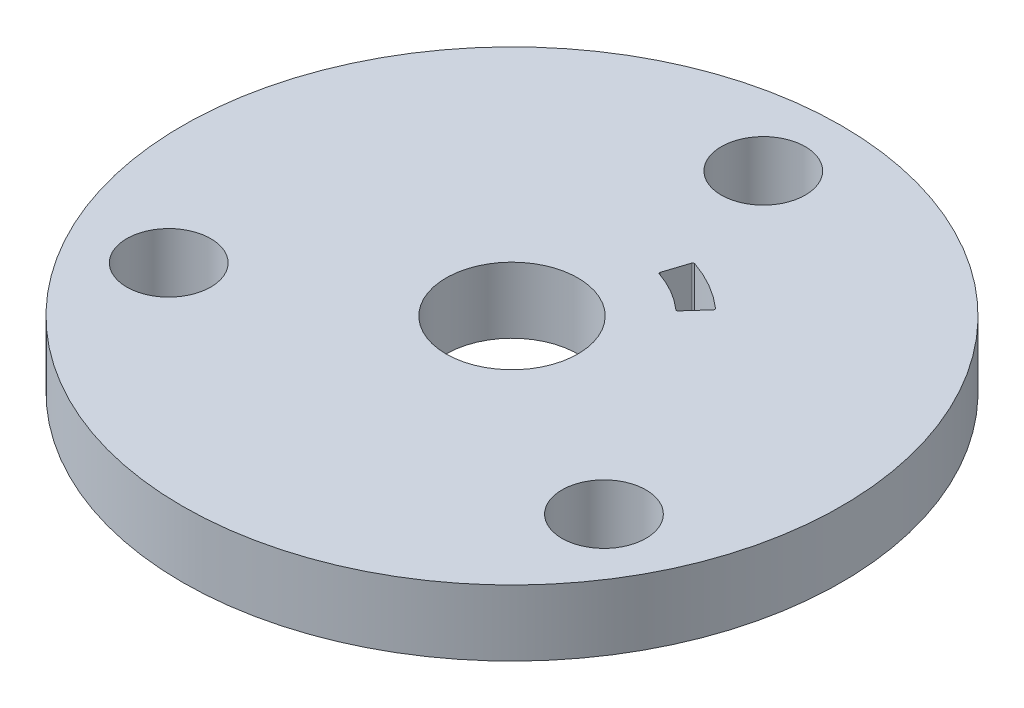
ISO-10303-21;
HEADER;
FILE_DESCRIPTION(('STEP AP214'),'2;1');
FILE_NAME('part.step','',(''),(''),'','','');
FILE_SCHEMA(('AUTOMOTIVE_DESIGN { 1 0 10303 214 1 1 1 1 }'));
ENDSEC;
DATA;
#1=APPLICATION_CONTEXT('core data for automotive mechanical design processes');
#2=APPLICATION_PROTOCOL_DEFINITION('international standard','automotive_design',2000,#1);
#3=PRODUCT_CONTEXT('',#1,'mechanical');
#4=PRODUCT('Part','Part','',(#3));
#5=PRODUCT_RELATED_PRODUCT_CATEGORY('part','',(#4));
#6=PRODUCT_DEFINITION_FORMATION('','',#4);
#7=PRODUCT_DEFINITION_CONTEXT('part definition',#1,'design');
#8=PRODUCT_DEFINITION('design','',#6,#7);
#9=PRODUCT_DEFINITION_SHAPE('','',#8);
#10=(LENGTH_UNIT() NAMED_UNIT(*) SI_UNIT(.MILLI.,.METRE.));
#11=(NAMED_UNIT(*) PLANE_ANGLE_UNIT() SI_UNIT($,.RADIAN.));
#12=(NAMED_UNIT(*) SI_UNIT($,.STERADIAN.) SOLID_ANGLE_UNIT());
#13=UNCERTAINTY_MEASURE_WITH_UNIT(LENGTH_MEASURE(1.E-05),#10,'distance_accuracy_value','');
#14=(GEOMETRIC_REPRESENTATION_CONTEXT(3) GLOBAL_UNCERTAINTY_ASSIGNED_CONTEXT((#13)) GLOBAL_UNIT_ASSIGNED_CONTEXT((#10,
#11,#12)) REPRESENTATION_CONTEXT('',''));
#15=CARTESIAN_POINT('',(0.,0.,0.));
#16=DIRECTION('',(0.,0.,1.));
#17=DIRECTION('',(1.,0.,0.));
#18=AXIS2_PLACEMENT_3D('',#15,#16,#17);
#19=CARTESIAN_POINT('',(0.,4.,0.));
#20=DIRECTION('',(0.,1.,0.));
#21=DIRECTION('',(0.,0.,1.));
#22=AXIS2_PLACEMENT_3D('',#19,#20,#21);
#23=PLANE('',#22);
#24=CARTESIAN_POINT('',(0.,4.,0.));
#25=DIRECTION('',(0.,1.,0.));
#26=DIRECTION('',(0.,0.,-1.));
#27=AXIS2_PLACEMENT_3D('',#24,#25,#26);
#28=CIRCLE('',#27,8.75);
#29=CARTESIAN_POINT('',(5.77932793090246,4.,-6.56976930090324));
#30=VERTEX_POINT('',#29);
#31=CARTESIAN_POINT('',(2.7999231461343,4.,-8.28992945541405));
#32=VERTEX_POINT('',#31);
#33=EDGE_CURVE('E132',#30,#32,#28,.T.);
#34=ORIENTED_EDGE('',*,*,#33,.F.);
#35=CARTESIAN_POINT('',(5.71327846883501,4.,-6.49468622317863));
#36=DIRECTION('',(0.,1.,0.));
#37=DIRECTION('',(0.,0.,1.));
#38=AXIS2_PLACEMENT_3D('',#35,#36,#37);
#39=CIRCLE('',#38,0.1);
#40=CARTESIAN_POINT('',(5.78759295138275,4.,-6.42777316254275));
#41=VERTEX_POINT('',#40);
#42=EDGE_CURVE('E183',#30,#41,#39,.F.);
#43=ORIENTED_EDGE('',*,*,#42,.T.);
#44=DIRECTION('',(0.669130606358867,0.,-0.743144825477386));
#45=VECTOR('',#44,1.);
#46=CARTESIAN_POINT('',(5.85489280564009,4.,-6.50251722292713));
#47=LINE('',#46,#45);
#48=CARTESIAN_POINT('',(4.78381588908025,4.,-5.31296579505114));
#49=VERTEX_POINT('',#48);
#50=EDGE_CURVE('E126',#49,#41,#47,.T.);
#51=ORIENTED_EDGE('',*,*,#50,.F.);
#52=CARTESIAN_POINT('',(4.70950140653251,4.,-5.37987885568702));
#53=DIRECTION('',(0.,1.,0.));
#54=DIRECTION('',(0.,0.,1.));
#55=AXIS2_PLACEMENT_3D('',#52,#53,#54);
#56=CIRCLE('',#55,0.1);
#57=CARTESIAN_POINT('',(4.64363425399359,4.,-5.30463579476832));
#58=VERTEX_POINT('',#57);
#59=EDGE_CURVE('E125',#49,#58,#56,.F.);
#60=ORIENTED_EDGE('',*,*,#59,.T.);
#61=CARTESIAN_POINT('',(0.,4.,0.));
#62=DIRECTION('',(0.,-1.,0.));
#63=DIRECTION('',(0.,0.,-1.));
#64=AXIS2_PLACEMENT_3D('',#61,#62,#63);
#65=CIRCLE('',#64,7.05);
#66=CARTESIAN_POINT('',(2.27213222909698,4.,-6.67382312722616));
#67=VERTEX_POINT('',#66);
#68=EDGE_CURVE('E115',#67,#58,#65,.T.);
#69=ORIENTED_EDGE('',*,*,#68,.F.);
#70=CARTESIAN_POINT('',(2.30436105504162,4.,-6.76848728505916));
#71=DIRECTION('',(0.,1.,0.));
#72=DIRECTION('',(0.,0.,1.));
#73=AXIS2_PLACEMENT_3D('',#70,#71,#72);
#74=CIRCLE('',#73,0.1);
#75=CARTESIAN_POINT('',(2.20925540341211,4.,-6.79938898449665));
#76=VERTEX_POINT('',#75);
#77=EDGE_CURVE('E98',#67,#76,#74,.F.);
#78=ORIENTED_EDGE('',*,*,#77,.T.);
#79=DIRECTION('',(-0.309016994374958,0.,0.95105651629515));
#80=VECTOR('',#79,1.);
#81=CARTESIAN_POINT('',(2.70389870078088,4.,-8.32174451758256));
#82=LINE('',#81,#80);
#83=CARTESIAN_POINT('',(2.67281837283468,4.,-8.22608910393253));
#84=VERTEX_POINT('',#83);
#85=EDGE_CURVE('E127',#84,#76,#82,.T.);
#86=ORIENTED_EDGE('',*,*,#85,.F.);
#87=CARTESIAN_POINT('',(2.76792402446419,4.,-8.19518740449503));
#88=DIRECTION('',(0.,1.,0.));
#89=DIRECTION('',(0.,0.,1.));
#90=AXIS2_PLACEMENT_3D('',#87,#88,#89);
#91=CIRCLE('',#90,0.1);
#92=EDGE_CURVE('E40',#84,#32,#91,.F.);
#93=ORIENTED_EDGE('',*,*,#92,.T.);
#94=EDGE_LOOP('',(#34,#43,#51,#60,#69,#78,#86,#93));
#95=FACE_BOUND('',#94,.T.);
#96=CARTESIAN_POINT('',(-13.2068874077127,4.,7.62500000000006));
#97=DIRECTION('',(0.,1.,0.));
#98=DIRECTION('',(0.866025403784436,0.,-0.500000000000004));
#99=AXIS2_PLACEMENT_3D('',#96,#97,#98);
#100=CIRCLE('',#99,2.55);
#101=CARTESIAN_POINT('',(-10.9985226280623,4.,6.35000000000005));
#102=VERTEX_POINT('',#101);
#103=EDGE_CURVE('E140',#102,#102,#100,.T.);
#104=ORIENTED_EDGE('',*,*,#103,.F.);
#105=EDGE_LOOP('',(#104));
#106=FACE_BOUND('',#105,.T.);
#107=CARTESIAN_POINT('',(13.2068874077128,4.,7.62499999999988));
#108=DIRECTION('',(0.,1.,0.));
#109=DIRECTION('',(-0.866025403784443,0.,-0.499999999999992));
#110=AXIS2_PLACEMENT_3D('',#107,#108,#109);
#111=CIRCLE('',#110,2.55);
#112=CARTESIAN_POINT('',(10.9985226280624,4.,6.3499999999999));
#113=VERTEX_POINT('',#112);
#114=EDGE_CURVE('E146',#113,#113,#111,.T.);
#115=ORIENTED_EDGE('',*,*,#114,.F.);
#116=EDGE_LOOP('',(#115));
#117=FACE_BOUND('',#116,.T.);
#118=CARTESIAN_POINT('',(0.,4.,-15.25));
#119=DIRECTION('',(0.,1.,0.));
#120=DIRECTION('',(0.,0.,1.));
#121=AXIS2_PLACEMENT_3D('',#118,#119,#120);
#122=CIRCLE('',#121,2.55);
#123=CARTESIAN_POINT('',(0.,4.,-12.7));
#124=VERTEX_POINT('',#123);
#125=EDGE_CURVE('E139',#124,#124,#122,.T.);
#126=ORIENTED_EDGE('',*,*,#125,.F.);
#127=EDGE_LOOP('',(#126));
#128=FACE_BOUND('',#127,.T.);
#129=CARTESIAN_POINT('',(0.,4.,0.));
#130=DIRECTION('',(0.,1.,0.));
#131=DIRECTION('',(0.,0.,1.));
#132=AXIS2_PLACEMENT_3D('',#129,#130,#131);
#133=CIRCLE('',#132,20.);
#134=CARTESIAN_POINT('',(0.,4.,20.));
#135=VERTEX_POINT('',#134);
#136=EDGE_CURVE('E162',#135,#135,#133,.T.);
#137=ORIENTED_EDGE('',*,*,#136,.T.);
#138=EDGE_LOOP('',(#137));
#139=FACE_BOUND('',#138,.T.);
#140=CARTESIAN_POINT('',(0.,4.,0.));
#141=DIRECTION('',(0.,1.,0.));
#142=DIRECTION('',(0.,0.,1.));
#143=AXIS2_PLACEMENT_3D('',#140,#141,#142);
#144=CIRCLE('',#143,4.);
#145=CARTESIAN_POINT('',(0.,4.,4.));
#146=VERTEX_POINT('',#145);
#147=EDGE_CURVE('E156',#146,#146,#144,.T.);
#148=ORIENTED_EDGE('',*,*,#147,.F.);
#149=EDGE_LOOP('',(#148));
#150=FACE_BOUND('',#149,.T.);
#151=ADVANCED_FACE('F32',(#95,#106,#117,#128,#139,#150),#23,.T.);
#152=CARTESIAN_POINT('',(0.,0.,0.));
#153=DIRECTION('',(0.,1.,0.));
#154=DIRECTION('',(0.,0.,1.));
#155=AXIS2_PLACEMENT_3D('',#152,#153,#154);
#156=PLANE('',#155);
#157=CARTESIAN_POINT('',(0.,0.,0.));
#158=DIRECTION('',(0.,-1.,0.));
#159=DIRECTION('',(0.,0.,-1.));
#160=AXIS2_PLACEMENT_3D('',#157,#158,#159);
#161=CIRCLE('',#160,7.05);
#162=CARTESIAN_POINT('',(2.27213222909698,0.,-6.67382312722616));
#163=VERTEX_POINT('',#162);
#164=CARTESIAN_POINT('',(4.64363425399359,0.,-5.30463579476832));
#165=VERTEX_POINT('',#164);
#166=EDGE_CURVE('E118',#163,#165,#161,.T.);
#167=ORIENTED_EDGE('',*,*,#166,.T.);
#168=CARTESIAN_POINT('',(4.70950140653251,0.,-5.37987885568702));
#169=DIRECTION('',(0.,1.,0.));
#170=DIRECTION('',(0.,0.,1.));
#171=AXIS2_PLACEMENT_3D('',#168,#169,#170);
#172=CIRCLE('',#171,0.1);
#173=CARTESIAN_POINT('',(4.78381588908025,0.,-5.31296579505114));
#174=VERTEX_POINT('',#173);
#175=EDGE_CURVE('E181',#165,#174,#172,.T.);
#176=ORIENTED_EDGE('',*,*,#175,.T.);
#177=DIRECTION('',(0.669130606358867,0.,-0.743144825477386));
#178=VECTOR('',#177,1.);
#179=CARTESIAN_POINT('',(5.85489280564009,0.,-6.50251722292713));
#180=LINE('',#179,#178);
#181=CARTESIAN_POINT('',(5.78759295138275,0.,-6.42777316254275));
#182=VERTEX_POINT('',#181);
#183=EDGE_CURVE('E149',#174,#182,#180,.T.);
#184=ORIENTED_EDGE('',*,*,#183,.T.);
#185=CARTESIAN_POINT('',(5.71327846883501,0.,-6.49468622317863));
#186=DIRECTION('',(0.,1.,0.));
#187=DIRECTION('',(0.,0.,1.));
#188=AXIS2_PLACEMENT_3D('',#185,#186,#187);
#189=CIRCLE('',#188,0.1);
#190=CARTESIAN_POINT('',(5.77932793090246,0.,-6.56976930090324));
#191=VERTEX_POINT('',#190);
#192=EDGE_CURVE('E54',#182,#191,#189,.T.);
#193=ORIENTED_EDGE('',*,*,#192,.T.);
#194=CARTESIAN_POINT('',(0.,0.,0.));
#195=DIRECTION('',(0.,1.,0.));
#196=DIRECTION('',(0.,0.,-1.));
#197=AXIS2_PLACEMENT_3D('',#194,#195,#196);
#198=CIRCLE('',#197,8.75);
#199=CARTESIAN_POINT('',(2.7999231461343,0.,-8.28992945541405));
#200=VERTEX_POINT('',#199);
#201=EDGE_CURVE('E130',#191,#200,#198,.T.);
#202=ORIENTED_EDGE('',*,*,#201,.T.);
#203=CARTESIAN_POINT('',(2.76792402446419,0.,-8.19518740449503));
#204=DIRECTION('',(0.,1.,0.));
#205=DIRECTION('',(0.,0.,1.));
#206=AXIS2_PLACEMENT_3D('',#203,#204,#205);
#207=CIRCLE('',#206,0.1);
#208=CARTESIAN_POINT('',(2.67281837283468,0.,-8.22608910393253));
#209=VERTEX_POINT('',#208);
#210=EDGE_CURVE('E11',#200,#209,#207,.T.);
#211=ORIENTED_EDGE('',*,*,#210,.T.);
#212=DIRECTION('',(-0.309016994374958,0.,0.95105651629515));
#213=VECTOR('',#212,1.);
#214=CARTESIAN_POINT('',(2.70389870078088,0.,-8.32174451758256));
#215=LINE('',#214,#213);
#216=CARTESIAN_POINT('',(2.20925540341211,0.,-6.79938898449665));
#217=VERTEX_POINT('',#216);
#218=EDGE_CURVE('E194',#209,#217,#215,.T.);
#219=ORIENTED_EDGE('',*,*,#218,.T.);
#220=CARTESIAN_POINT('',(2.30436105504162,0.,-6.76848728505916));
#221=DIRECTION('',(0.,1.,0.));
#222=DIRECTION('',(0.,0.,1.));
#223=AXIS2_PLACEMENT_3D('',#220,#221,#222);
#224=CIRCLE('',#223,0.1);
#225=EDGE_CURVE('E108',#217,#163,#224,.T.);
#226=ORIENTED_EDGE('',*,*,#225,.T.);
#227=EDGE_LOOP('',(#167,#176,#184,#193,#202,#211,#219,#226));
#228=FACE_BOUND('',#227,.T.);
#229=CARTESIAN_POINT('',(-13.2068874077127,0.,7.62500000000006));
#230=DIRECTION('',(0.,1.,0.));
#231=DIRECTION('',(0.866025403784436,0.,-0.500000000000004));
#232=AXIS2_PLACEMENT_3D('',#229,#230,#231);
#233=CIRCLE('',#232,2.55);
#234=CARTESIAN_POINT('',(-10.9985226280623,0.,6.35000000000005));
#235=VERTEX_POINT('',#234);
#236=EDGE_CURVE('E136',#235,#235,#233,.T.);
#237=ORIENTED_EDGE('',*,*,#236,.T.);
#238=EDGE_LOOP('',(#237));
#239=FACE_BOUND('',#238,.T.);
#240=CARTESIAN_POINT('',(13.2068874077128,0.,7.62499999999988));
#241=DIRECTION('',(0.,1.,0.));
#242=DIRECTION('',(-0.866025403784443,0.,-0.499999999999992));
#243=AXIS2_PLACEMENT_3D('',#240,#241,#242);
#244=CIRCLE('',#243,2.55);
#245=CARTESIAN_POINT('',(10.9985226280624,0.,6.3499999999999));
#246=VERTEX_POINT('',#245);
#247=EDGE_CURVE('E143',#246,#246,#244,.T.);
#248=ORIENTED_EDGE('',*,*,#247,.T.);
#249=EDGE_LOOP('',(#248));
#250=FACE_BOUND('',#249,.T.);
#251=CARTESIAN_POINT('',(0.,0.,-15.25));
#252=DIRECTION('',(0.,1.,0.));
#253=DIRECTION('',(0.,0.,1.));
#254=AXIS2_PLACEMENT_3D('',#251,#252,#253);
#255=CIRCLE('',#254,2.55);
#256=CARTESIAN_POINT('',(0.,0.,-12.7));
#257=VERTEX_POINT('',#256);
#258=EDGE_CURVE('E150',#257,#257,#255,.T.);
#259=ORIENTED_EDGE('',*,*,#258,.T.);
#260=EDGE_LOOP('',(#259));
#261=FACE_BOUND('',#260,.T.);
#262=CARTESIAN_POINT('',(0.,0.,0.));
#263=DIRECTION('',(0.,1.,0.));
#264=DIRECTION('',(0.,0.,1.));
#265=AXIS2_PLACEMENT_3D('',#262,#263,#264);
#266=CIRCLE('',#265,20.);
#267=CARTESIAN_POINT('',(0.,0.,20.));
#268=VERTEX_POINT('',#267);
#269=EDGE_CURVE('E159',#268,#268,#266,.T.);
#270=ORIENTED_EDGE('',*,*,#269,.F.);
#271=EDGE_LOOP('',(#270));
#272=FACE_BOUND('',#271,.T.);
#273=CARTESIAN_POINT('',(0.,0.,0.));
#274=DIRECTION('',(0.,1.,0.));
#275=DIRECTION('',(0.,0.,1.));
#276=AXIS2_PLACEMENT_3D('',#273,#274,#275);
#277=CIRCLE('',#276,4.);
#278=CARTESIAN_POINT('',(0.,0.,4.));
#279=VERTEX_POINT('',#278);
#280=EDGE_CURVE('E153',#279,#279,#277,.T.);
#281=ORIENTED_EDGE('',*,*,#280,.T.);
#282=EDGE_LOOP('',(#281));
#283=FACE_BOUND('',#282,.T.);
#284=ADVANCED_FACE('F192',(#228,#239,#250,#261,#272,#283),#156,.F.);
#285=CARTESIAN_POINT('',(0.,4.,0.));
#286=DIRECTION('',(0.,-1.,0.));
#287=DIRECTION('',(0.,0.,-1.));
#288=AXIS2_PLACEMENT_3D('',#285,#286,#287);
#289=CYLINDRICAL_SURFACE('',#288,20.);
#290=ORIENTED_EDGE('',*,*,#136,.F.);
#291=EDGE_LOOP('',(#290));
#292=FACE_BOUND('',#291,.T.);
#293=ORIENTED_EDGE('',*,*,#269,.T.);
#294=EDGE_LOOP('',(#293));
#295=FACE_BOUND('',#294,.T.);
#296=ADVANCED_FACE('F224',(#292,#295),#289,.T.);
#297=CARTESIAN_POINT('',(0.,4.,0.));
#298=DIRECTION('',(0.,-1.,0.));
#299=DIRECTION('',(0.,0.,-1.));
#300=AXIS2_PLACEMENT_3D('',#297,#298,#299);
#301=CYLINDRICAL_SURFACE('',#300,4.);
#302=ORIENTED_EDGE('',*,*,#147,.T.);
#303=EDGE_LOOP('',(#302));
#304=FACE_BOUND('',#303,.T.);
#305=ORIENTED_EDGE('',*,*,#280,.F.);
#306=EDGE_LOOP('',(#305));
#307=FACE_BOUND('',#306,.T.);
#308=ADVANCED_FACE('F227',(#304,#307),#301,.F.);
#309=CARTESIAN_POINT('',(0.,0.,-15.25));
#310=DIRECTION('',(0.,1.,0.));
#311=DIRECTION('',(0.,0.,1.));
#312=AXIS2_PLACEMENT_3D('',#309,#310,#311);
#313=CYLINDRICAL_SURFACE('',#312,2.55);
#314=ORIENTED_EDGE('',*,*,#258,.F.);
#315=EDGE_LOOP('',(#314));
#316=FACE_BOUND('',#315,.T.);
#317=ORIENTED_EDGE('',*,*,#125,.T.);
#318=EDGE_LOOP('',(#317));
#319=FACE_BOUND('',#318,.T.);
#320=ADVANCED_FACE('F236',(#316,#319),#313,.F.);
#321=CARTESIAN_POINT('',(13.2068874077128,0.,7.62499999999988));
#322=DIRECTION('',(0.,1.,0.));
#323=DIRECTION('',(0.,0.,1.));
#324=AXIS2_PLACEMENT_3D('',#321,#322,#323);
#325=CYLINDRICAL_SURFACE('',#324,2.55);
#326=ORIENTED_EDGE('',*,*,#247,.F.);
#327=EDGE_LOOP('',(#326));
#328=FACE_BOUND('',#327,.T.);
#329=ORIENTED_EDGE('',*,*,#114,.T.);
#330=EDGE_LOOP('',(#329));
#331=FACE_BOUND('',#330,.T.);
#332=ADVANCED_FACE('F251',(#328,#331),#325,.F.);
#333=CARTESIAN_POINT('',(-13.2068874077127,0.,7.62500000000006));
#334=DIRECTION('',(0.,1.,0.));
#335=DIRECTION('',(0.,0.,1.));
#336=AXIS2_PLACEMENT_3D('',#333,#334,#335);
#337=CYLINDRICAL_SURFACE('',#336,2.55);
#338=ORIENTED_EDGE('',*,*,#236,.F.);
#339=EDGE_LOOP('',(#338));
#340=FACE_BOUND('',#339,.T.);
#341=ORIENTED_EDGE('',*,*,#103,.T.);
#342=EDGE_LOOP('',(#341));
#343=FACE_BOUND('',#342,.T.);
#344=ADVANCED_FACE('F256',(#340,#343),#337,.F.);
#345=CARTESIAN_POINT('',(0.,0.,0.));
#346=DIRECTION('',(0.,1.,0.));
#347=DIRECTION('',(0.,0.,1.));
#348=AXIS2_PLACEMENT_3D('',#345,#346,#347);
#349=CYLINDRICAL_SURFACE('',#348,8.75);
#350=ORIENTED_EDGE('',*,*,#201,.F.);
#351=DIRECTION('',(0.,1.,0.));
#352=VECTOR('',#351,1.);
#353=CARTESIAN_POINT('',(5.77932793090246,0.,-6.56976930090324));
#354=LINE('',#353,#352);
#355=EDGE_CURVE('E109',#191,#30,#354,.T.);
#356=ORIENTED_EDGE('',*,*,#355,.T.);
#357=ORIENTED_EDGE('',*,*,#33,.T.);
#358=DIRECTION('',(0.,1.,0.));
#359=VECTOR('',#358,1.);
#360=CARTESIAN_POINT('',(2.7999231461343,0.,-8.28992945541405));
#361=LINE('',#360,#359);
#362=EDGE_CURVE('E47',#32,#200,#361,.F.);
#363=ORIENTED_EDGE('',*,*,#362,.T.);
#364=EDGE_LOOP('',(#350,#356,#357,#363));
#365=FACE_BOUND('',#364,.T.);
#366=ADVANCED_FACE('F187',(#365),#349,.F.);
#367=CARTESIAN_POINT('',(5.85489280564009,0.,-6.50251722292713));
#368=DIRECTION('',(0.743144825477386,0.,0.669130606358867));
#369=DIRECTION('',(0.669130606358867,0.,-0.743144825477386));
#370=AXIS2_PLACEMENT_3D('',#367,#368,#369);
#371=PLANE('',#370);
#372=ORIENTED_EDGE('',*,*,#183,.F.);
#373=DIRECTION('',(0.,-1.,0.));
#374=VECTOR('',#373,1.);
#375=CARTESIAN_POINT('',(4.78381588908025,4.,-5.31296579505114));
#376=LINE('',#375,#374);
#377=EDGE_CURVE('E173',#174,#49,#376,.F.);
#378=ORIENTED_EDGE('',*,*,#377,.T.);
#379=ORIENTED_EDGE('',*,*,#50,.T.);
#380=DIRECTION('',(0.,-1.,0.));
#381=VECTOR('',#380,1.);
#382=CARTESIAN_POINT('',(5.78759295138275,0.,-6.42777316254275));
#383=LINE('',#382,#381);
#384=EDGE_CURVE('E171',#41,#182,#383,.T.);
#385=ORIENTED_EDGE('',*,*,#384,.T.);
#386=EDGE_LOOP('',(#372,#378,#379,#385));
#387=FACE_BOUND('',#386,.T.);
#388=ADVANCED_FACE('F208',(#387),#371,.F.);
#389=CARTESIAN_POINT('',(0.,0.,0.));
#390=DIRECTION('',(0.,1.,0.));
#391=DIRECTION('',(0.,0.,1.));
#392=AXIS2_PLACEMENT_3D('',#389,#390,#391);
#393=CYLINDRICAL_SURFACE('',#392,7.05);
#394=ORIENTED_EDGE('',*,*,#166,.F.);
#395=DIRECTION('',(0.,1.,0.));
#396=VECTOR('',#395,1.);
#397=CARTESIAN_POINT('',(2.27213222909698,0.,-6.67382312722616));
#398=LINE('',#397,#396);
#399=EDGE_CURVE('E102',#163,#67,#398,.T.);
#400=ORIENTED_EDGE('',*,*,#399,.T.);
#401=ORIENTED_EDGE('',*,*,#68,.T.);
#402=DIRECTION('',(0.,1.,0.));
#403=VECTOR('',#402,1.);
#404=CARTESIAN_POINT('',(4.64363425399359,0.,-5.30463579476832));
#405=LINE('',#404,#403);
#406=EDGE_CURVE('E120',#58,#165,#405,.F.);
#407=ORIENTED_EDGE('',*,*,#406,.T.);
#408=EDGE_LOOP('',(#394,#400,#401,#407));
#409=FACE_BOUND('',#408,.T.);
#410=ADVANCED_FACE('F114',(#409),#393,.T.);
#411=CARTESIAN_POINT('',(2.70389870078088,0.,-8.32174451758256));
#412=DIRECTION('',(-0.95105651629515,0.,-0.309016994374958));
#413=DIRECTION('',(-0.309016994374958,0.,0.95105651629515));
#414=AXIS2_PLACEMENT_3D('',#411,#412,#413);
#415=PLANE('',#414);
#416=ORIENTED_EDGE('',*,*,#85,.T.);
#417=DIRECTION('',(0.,-1.,0.));
#418=VECTOR('',#417,1.);
#419=CARTESIAN_POINT('',(2.20925540341211,0.,-6.79938898449665));
#420=LINE('',#419,#418);
#421=EDGE_CURVE('E103',#76,#217,#420,.T.);
#422=ORIENTED_EDGE('',*,*,#421,.T.);
#423=ORIENTED_EDGE('',*,*,#218,.F.);
#424=DIRECTION('',(0.,-1.,0.));
#425=VECTOR('',#424,1.);
#426=CARTESIAN_POINT('',(2.67281837283468,4.,-8.22608910393253));
#427=LINE('',#426,#425);
#428=EDGE_CURVE('E119',#209,#84,#427,.F.);
#429=ORIENTED_EDGE('',*,*,#428,.T.);
#430=EDGE_LOOP('',(#416,#422,#423,#429));
#431=FACE_BOUND('',#430,.T.);
#432=ADVANCED_FACE('F196',(#431),#415,.F.);
#433=CARTESIAN_POINT('',(2.30436105504162,0.,-6.76848728505916));
#434=DIRECTION('',(0.,1.,0.));
#435=DIRECTION('',(0.,0.,1.));
#436=AXIS2_PLACEMENT_3D('',#433,#434,#435);
#437=CYLINDRICAL_SURFACE('',#436,0.1);
#438=ORIENTED_EDGE('',*,*,#225,.F.);
#439=ORIENTED_EDGE('',*,*,#421,.F.);
#440=ORIENTED_EDGE('',*,*,#77,.F.);
#441=ORIENTED_EDGE('',*,*,#399,.F.);
#442=EDGE_LOOP('',(#438,#439,#440,#441));
#443=FACE_BOUND('',#442,.T.);
#444=ADVANCED_FACE('F101',(#443),#437,.F.);
#445=CARTESIAN_POINT('',(4.70950140653251,0.,-5.37987885568702));
#446=DIRECTION('',(0.,1.,0.));
#447=DIRECTION('',(0.,0.,1.));
#448=AXIS2_PLACEMENT_3D('',#445,#446,#447);
#449=CYLINDRICAL_SURFACE('',#448,0.1);
#450=ORIENTED_EDGE('',*,*,#175,.F.);
#451=ORIENTED_EDGE('',*,*,#406,.F.);
#452=ORIENTED_EDGE('',*,*,#59,.F.);
#453=ORIENTED_EDGE('',*,*,#377,.F.);
#454=EDGE_LOOP('',(#450,#451,#452,#453));
#455=FACE_BOUND('',#454,.T.);
#456=ADVANCED_FACE('F210',(#455),#449,.F.);
#457=CARTESIAN_POINT('',(5.71327846883501,0.,-6.49468622317863));
#458=DIRECTION('',(0.,1.,0.));
#459=DIRECTION('',(0.,0.,1.));
#460=AXIS2_PLACEMENT_3D('',#457,#458,#459);
#461=CYLINDRICAL_SURFACE('',#460,0.1);
#462=ORIENTED_EDGE('',*,*,#192,.F.);
#463=ORIENTED_EDGE('',*,*,#384,.F.);
#464=ORIENTED_EDGE('',*,*,#42,.F.);
#465=ORIENTED_EDGE('',*,*,#355,.F.);
#466=EDGE_LOOP('',(#462,#463,#464,#465));
#467=FACE_BOUND('',#466,.T.);
#468=ADVANCED_FACE('F207',(#467),#461,.F.);
#469=CARTESIAN_POINT('',(2.76792402446419,0.,-8.19518740449503));
#470=DIRECTION('',(0.,1.,0.));
#471=DIRECTION('',(0.,0.,1.));
#472=AXIS2_PLACEMENT_3D('',#469,#470,#471);
#473=CYLINDRICAL_SURFACE('',#472,0.1);
#474=ORIENTED_EDGE('',*,*,#210,.F.);
#475=ORIENTED_EDGE('',*,*,#362,.F.);
#476=ORIENTED_EDGE('',*,*,#92,.F.);
#477=ORIENTED_EDGE('',*,*,#428,.F.);
#478=EDGE_LOOP('',(#474,#475,#476,#477));
#479=FACE_BOUND('',#478,.T.);
#480=ADVANCED_FACE('F34',(#479),#473,.F.);
#481=CLOSED_SHELL('',(#151,#284,#296,#308,#320,#332,#344,#366,#388,#410,#432,#444,#456,#468,#480));
#482=MANIFOLD_SOLID_BREP('B2',#481);
#483=ADVANCED_BREP_SHAPE_REPRESENTATION('',(#18,#482),#14);
#484=SHAPE_DEFINITION_REPRESENTATION(#9,#483);
ENDSEC;
END-ISO-10303-21;
